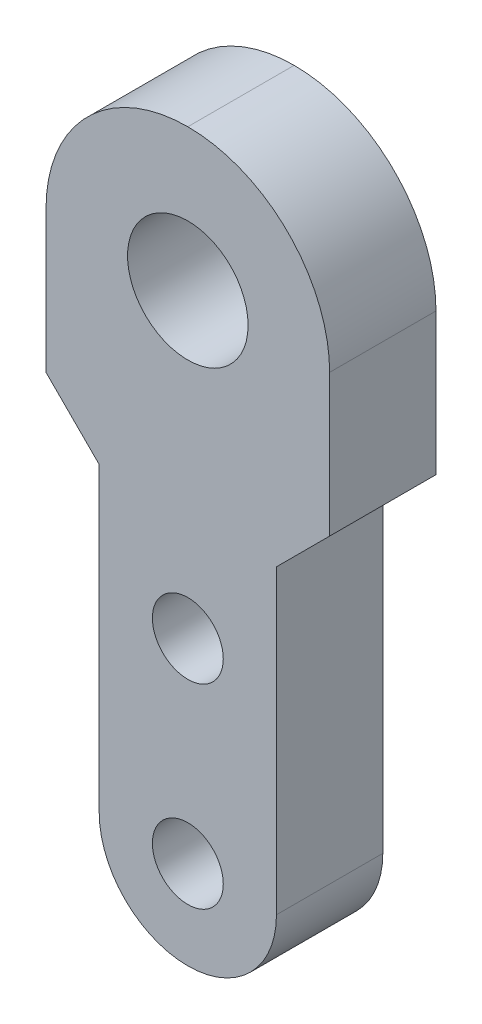
ISO-10303-21;
HEADER;
FILE_DESCRIPTION(('STEP AP214'),'2;1');
FILE_NAME('part.step','',(''),(''),'','','');
FILE_SCHEMA(('AUTOMOTIVE_DESIGN { 1 0 10303 214 1 1 1 1 }'));
ENDSEC;
DATA;
#1=APPLICATION_CONTEXT('core data for automotive mechanical design processes');
#2=APPLICATION_PROTOCOL_DEFINITION('international standard','automotive_design',2000,#1);
#3=PRODUCT_CONTEXT('',#1,'mechanical');
#4=PRODUCT('Part','Part','',(#3));
#5=PRODUCT_RELATED_PRODUCT_CATEGORY('part','',(#4));
#6=PRODUCT_DEFINITION_FORMATION('','',#4);
#7=PRODUCT_DEFINITION_CONTEXT('part definition',#1,'design');
#8=PRODUCT_DEFINITION('design','',#6,#7);
#9=PRODUCT_DEFINITION_SHAPE('','',#8);
#10=(LENGTH_UNIT() NAMED_UNIT(*) SI_UNIT(.MILLI.,.METRE.));
#11=(NAMED_UNIT(*) PLANE_ANGLE_UNIT() SI_UNIT($,.RADIAN.));
#12=(NAMED_UNIT(*) SI_UNIT($,.STERADIAN.) SOLID_ANGLE_UNIT());
#13=UNCERTAINTY_MEASURE_WITH_UNIT(LENGTH_MEASURE(1.E-05),#10,'distance_accuracy_value','');
#14=(GEOMETRIC_REPRESENTATION_CONTEXT(3) GLOBAL_UNCERTAINTY_ASSIGNED_CONTEXT((#13)) GLOBAL_UNIT_ASSIGNED_CONTEXT((#10,
#11,#12)) REPRESENTATION_CONTEXT('',''));
#15=CARTESIAN_POINT('',(0.,0.,0.));
#16=DIRECTION('',(0.,0.,1.));
#17=DIRECTION('',(1.,0.,0.));
#18=AXIS2_PLACEMENT_3D('',#15,#16,#17);
#19=CARTESIAN_POINT('',(0.,0.,6.));
#20=DIRECTION('',(1.,0.,0.));
#21=DIRECTION('',(0.,0.,-1.));
#22=AXIS2_PLACEMENT_3D('',#19,#20,#21);
#23=PLANE('',#22);
#24=DIRECTION('',(0.,-1.,0.));
#25=VECTOR('',#24,1.);
#26=CARTESIAN_POINT('',(0.,0.,0.));
#27=LINE('',#26,#25);
#28=CARTESIAN_POINT('',(0.,22.,0.));
#29=VERTEX_POINT('',#28);
#30=CARTESIAN_POINT('',(0.,5.,0.));
#31=VERTEX_POINT('',#30);
#32=EDGE_CURVE('E116',#29,#31,#27,.T.);
#33=ORIENTED_EDGE('',*,*,#32,.T.);
#34=DIRECTION('',(0.,0.,-1.));
#35=VECTOR('',#34,1.);
#36=CARTESIAN_POINT('',(0.,5.,6.));
#37=LINE('',#36,#35);
#38=CARTESIAN_POINT('',(0.,5.,6.));
#39=VERTEX_POINT('',#38);
#40=EDGE_CURVE('E11',#31,#39,#37,.F.);
#41=ORIENTED_EDGE('',*,*,#40,.T.);
#42=DIRECTION('',(0.,-1.,0.));
#43=VECTOR('',#42,1.);
#44=CARTESIAN_POINT('',(0.,0.,6.));
#45=LINE('',#44,#43);
#46=CARTESIAN_POINT('',(0.,22.,6.));
#47=VERTEX_POINT('',#46);
#48=EDGE_CURVE('E141',#47,#39,#45,.T.);
#49=ORIENTED_EDGE('',*,*,#48,.F.);
#50=DIRECTION('',(0.,0.,-1.));
#51=VECTOR('',#50,1.);
#52=CARTESIAN_POINT('',(0.,22.,6.));
#53=LINE('',#52,#51);
#54=EDGE_CURVE('E167',#47,#29,#53,.T.);
#55=ORIENTED_EDGE('',*,*,#54,.T.);
#56=EDGE_LOOP('',(#33,#41,#49,#55));
#57=FACE_BOUND('',#56,.T.);
#58=ADVANCED_FACE('F32',(#57),#23,.F.);
#59=CARTESIAN_POINT('',(10.,0.,6.));
#60=DIRECTION('',(-1.,0.,0.));
#61=DIRECTION('',(0.,0.,1.));
#62=AXIS2_PLACEMENT_3D('',#59,#60,#61);
#63=PLANE('',#62);
#64=DIRECTION('',(0.,1.,0.));
#65=VECTOR('',#64,1.);
#66=CARTESIAN_POINT('',(10.,0.,6.));
#67=LINE('',#66,#65);
#68=CARTESIAN_POINT('',(10.,5.,6.));
#69=VERTEX_POINT('',#68);
#70=CARTESIAN_POINT('',(10.,22.,6.));
#71=VERTEX_POINT('',#70);
#72=EDGE_CURVE('E143',#69,#71,#67,.T.);
#73=ORIENTED_EDGE('',*,*,#72,.F.);
#74=DIRECTION('',(0.,0.,-1.));
#75=VECTOR('',#74,1.);
#76=CARTESIAN_POINT('',(10.,5.,6.));
#77=LINE('',#76,#75);
#78=CARTESIAN_POINT('',(10.,5.,0.));
#79=VERTEX_POINT('',#78);
#80=EDGE_CURVE('E174',#69,#79,#77,.T.);
#81=ORIENTED_EDGE('',*,*,#80,.T.);
#82=DIRECTION('',(0.,1.,0.));
#83=VECTOR('',#82,1.);
#84=CARTESIAN_POINT('',(10.,0.,0.));
#85=LINE('',#84,#83);
#86=CARTESIAN_POINT('',(10.,22.,0.));
#87=VERTEX_POINT('',#86);
#88=EDGE_CURVE('E144',#79,#87,#85,.T.);
#89=ORIENTED_EDGE('',*,*,#88,.T.);
#90=DIRECTION('',(0.,0.,1.));
#91=VECTOR('',#90,1.);
#92=CARTESIAN_POINT('',(10.,22.,6.));
#93=LINE('',#92,#91);
#94=EDGE_CURVE('E160',#87,#71,#93,.T.);
#95=ORIENTED_EDGE('',*,*,#94,.T.);
#96=EDGE_LOOP('',(#73,#81,#89,#95));
#97=FACE_BOUND('',#96,.T.);
#98=ADVANCED_FACE('F189',(#97),#63,.F.);
#99=CARTESIAN_POINT('',(0.,0.,6.));
#100=DIRECTION('',(0.,0.,-1.));
#101=DIRECTION('',(-1.,0.,0.));
#102=AXIS2_PLACEMENT_3D('',#99,#100,#101);
#103=PLANE('',#102);
#104=CARTESIAN_POINT('',(5.00000000000001,16.,6.));
#105=DIRECTION('',(0.,0.,1.));
#106=DIRECTION('',(1.,0.,0.));
#107=AXIS2_PLACEMENT_3D('',#104,#105,#106);
#108=CIRCLE('',#107,2.);
#109=CARTESIAN_POINT('',(7.00000000000001,16.,6.));
#110=VERTEX_POINT('',#109);
#111=EDGE_CURVE('E248',#110,#110,#108,.T.);
#112=ORIENTED_EDGE('',*,*,#111,.F.);
#113=EDGE_LOOP('',(#112));
#114=FACE_BOUND('',#113,.T.);
#115=CARTESIAN_POINT('',(5.00000000000001,5.,6.));
#116=DIRECTION('',(0.,0.,1.));
#117=DIRECTION('',(1.,0.,0.));
#118=AXIS2_PLACEMENT_3D('',#115,#116,#117);
#119=CIRCLE('',#118,2.);
#120=CARTESIAN_POINT('',(7.00000000000001,5.,6.));
#121=VERTEX_POINT('',#120);
#122=EDGE_CURVE('E164',#121,#121,#119,.T.);
#123=ORIENTED_EDGE('',*,*,#122,.F.);
#124=EDGE_LOOP('',(#123));
#125=FACE_BOUND('',#124,.T.);
#126=CARTESIAN_POINT('',(5.,33.,6.));
#127=DIRECTION('',(0.,0.,1.));
#128=DIRECTION('',(1.,0.,0.));
#129=AXIS2_PLACEMENT_3D('',#126,#127,#128);
#130=CIRCLE('',#129,3.4);
#131=CARTESIAN_POINT('',(8.4,33.,6.));
#132=VERTEX_POINT('',#131);
#133=EDGE_CURVE('E236',#132,#132,#130,.T.);
#134=ORIENTED_EDGE('',*,*,#133,.F.);
#135=EDGE_LOOP('',(#134));
#136=FACE_BOUND('',#135,.T.);
#137=CARTESIAN_POINT('',(5.,5.,6.));
#138=DIRECTION('',(0.,0.,-1.));
#139=DIRECTION('',(-1.,0.,0.));
#140=AXIS2_PLACEMENT_3D('',#137,#138,#139);
#141=CIRCLE('',#140,5.);
#142=CARTESIAN_POINT('',(5.,0.,6.));
#143=VERTEX_POINT('',#142);
#144=EDGE_CURVE('E48',#39,#143,#141,.F.);
#145=ORIENTED_EDGE('',*,*,#144,.T.);
#146=CARTESIAN_POINT('',(5.,5.,6.));
#147=DIRECTION('',(0.,0.,-1.));
#148=DIRECTION('',(-1.,0.,0.));
#149=AXIS2_PLACEMENT_3D('',#146,#147,#148);
#150=CIRCLE('',#149,5.);
#151=EDGE_CURVE('E41',#143,#69,#150,.F.);
#152=ORIENTED_EDGE('',*,*,#151,.T.);
#153=ORIENTED_EDGE('',*,*,#72,.T.);
#154=DIRECTION('',(0.707106781186552,0.707106781186543,0.));
#155=VECTOR('',#154,1.);
#156=CARTESIAN_POINT('',(-6.00000000000007,6.00000000000014,6.));
#157=LINE('',#156,#155);
#158=CARTESIAN_POINT('',(13.,25.,6.));
#159=VERTEX_POINT('',#158);
#160=EDGE_CURVE('E122',#71,#159,#157,.T.);
#161=ORIENTED_EDGE('',*,*,#160,.T.);
#162=DIRECTION('',(0.,1.,0.));
#163=VECTOR('',#162,1.);
#164=CARTESIAN_POINT('',(13.,41.,6.));
#165=LINE('',#164,#163);
#166=CARTESIAN_POINT('',(13.,33.,6.));
#167=VERTEX_POINT('',#166);
#168=EDGE_CURVE('E226',#159,#167,#165,.T.);
#169=ORIENTED_EDGE('',*,*,#168,.T.);
#170=CARTESIAN_POINT('',(5.,33.,6.));
#171=DIRECTION('',(0.,0.,-1.));
#172=DIRECTION('',(-1.,0.,0.));
#173=AXIS2_PLACEMENT_3D('',#170,#171,#172);
#174=CIRCLE('',#173,8.);
#175=CARTESIAN_POINT('',(5.,41.,6.));
#176=VERTEX_POINT('',#175);
#177=EDGE_CURVE('E153',#167,#176,#174,.F.);
#178=ORIENTED_EDGE('',*,*,#177,.T.);
#179=CARTESIAN_POINT('',(5.,33.,6.));
#180=DIRECTION('',(0.,0.,-1.));
#181=DIRECTION('',(-1.,0.,0.));
#182=AXIS2_PLACEMENT_3D('',#179,#180,#181);
#183=CIRCLE('',#182,8.);
#184=CARTESIAN_POINT('',(-3.,33.,6.));
#185=VERTEX_POINT('',#184);
#186=EDGE_CURVE('E151',#176,#185,#183,.F.);
#187=ORIENTED_EDGE('',*,*,#186,.T.);
#188=DIRECTION('',(0.,-1.,0.));
#189=VECTOR('',#188,1.);
#190=CARTESIAN_POINT('',(-3.,41.,6.));
#191=LINE('',#190,#189);
#192=CARTESIAN_POINT('',(-3.,25.,6.));
#193=VERTEX_POINT('',#192);
#194=EDGE_CURVE('E232',#185,#193,#191,.T.);
#195=ORIENTED_EDGE('',*,*,#194,.T.);
#196=DIRECTION('',(0.707106781186544,-0.707106781186551,0.));
#197=VECTOR('',#196,1.);
#198=CARTESIAN_POINT('',(11.,10.9999999999999,6.));
#199=LINE('',#198,#197);
#200=EDGE_CURVE('E121',#193,#47,#199,.T.);
#201=ORIENTED_EDGE('',*,*,#200,.T.);
#202=ORIENTED_EDGE('',*,*,#48,.T.);
#203=EDGE_LOOP('',(#145,#152,#153,#161,#169,#178,#187,#195,#201,#202));
#204=FACE_BOUND('',#203,.T.);
#205=ADVANCED_FACE('F184',(#114,#125,#136,#204),#103,.F.);
#206=CARTESIAN_POINT('',(0.,0.,0.));
#207=DIRECTION('',(0.,0.,-1.));
#208=DIRECTION('',(-1.,0.,0.));
#209=AXIS2_PLACEMENT_3D('',#206,#207,#208);
#210=PLANE('',#209);
#211=CARTESIAN_POINT('',(5.00000000000001,16.,0.));
#212=DIRECTION('',(0.,0.,1.));
#213=DIRECTION('',(1.,0.,0.));
#214=AXIS2_PLACEMENT_3D('',#211,#212,#213);
#215=CIRCLE('',#214,2.);
#216=CARTESIAN_POINT('',(7.00000000000001,16.,0.));
#217=VERTEX_POINT('',#216);
#218=EDGE_CURVE('E241',#217,#217,#215,.T.);
#219=ORIENTED_EDGE('',*,*,#218,.T.);
#220=EDGE_LOOP('',(#219));
#221=FACE_BOUND('',#220,.T.);
#222=CARTESIAN_POINT('',(5.00000000000001,5.,0.));
#223=DIRECTION('',(0.,0.,1.));
#224=DIRECTION('',(1.,0.,0.));
#225=AXIS2_PLACEMENT_3D('',#222,#223,#224);
#226=CIRCLE('',#225,2.);
#227=CARTESIAN_POINT('',(7.00000000000001,5.,0.));
#228=VERTEX_POINT('',#227);
#229=EDGE_CURVE('E245',#228,#228,#226,.T.);
#230=ORIENTED_EDGE('',*,*,#229,.T.);
#231=EDGE_LOOP('',(#230));
#232=FACE_BOUND('',#231,.T.);
#233=CARTESIAN_POINT('',(5.,33.,0.));
#234=DIRECTION('',(0.,0.,1.));
#235=DIRECTION('',(1.,0.,0.));
#236=AXIS2_PLACEMENT_3D('',#233,#234,#235);
#237=CIRCLE('',#236,3.4);
#238=CARTESIAN_POINT('',(8.4,33.,0.));
#239=VERTEX_POINT('',#238);
#240=EDGE_CURVE('E233',#239,#239,#237,.T.);
#241=ORIENTED_EDGE('',*,*,#240,.T.);
#242=EDGE_LOOP('',(#241));
#243=FACE_BOUND('',#242,.T.);
#244=ORIENTED_EDGE('',*,*,#88,.F.);
#245=CARTESIAN_POINT('',(5.,5.,0.));
#246=DIRECTION('',(0.,0.,-1.));
#247=DIRECTION('',(-1.,0.,0.));
#248=AXIS2_PLACEMENT_3D('',#245,#246,#247);
#249=CIRCLE('',#248,5.);
#250=CARTESIAN_POINT('',(5.,0.,0.));
#251=VERTEX_POINT('',#250);
#252=EDGE_CURVE('E179',#79,#251,#249,.T.);
#253=ORIENTED_EDGE('',*,*,#252,.T.);
#254=CARTESIAN_POINT('',(5.,5.,0.));
#255=DIRECTION('',(0.,0.,-1.));
#256=DIRECTION('',(-1.,0.,0.));
#257=AXIS2_PLACEMENT_3D('',#254,#255,#256);
#258=CIRCLE('',#257,5.);
#259=EDGE_CURVE('E177',#251,#31,#258,.T.);
#260=ORIENTED_EDGE('',*,*,#259,.T.);
#261=ORIENTED_EDGE('',*,*,#32,.F.);
#262=DIRECTION('',(-0.707106781186544,0.707106781186551,0.));
#263=VECTOR('',#262,1.);
#264=CARTESIAN_POINT('',(0.,22.,0.));
#265=LINE('',#264,#263);
#266=CARTESIAN_POINT('',(-3.,25.,0.));
#267=VERTEX_POINT('',#266);
#268=EDGE_CURVE('E110',#29,#267,#265,.T.);
#269=ORIENTED_EDGE('',*,*,#268,.T.);
#270=DIRECTION('',(0.,-1.,0.));
#271=VECTOR('',#270,1.);
#272=CARTESIAN_POINT('',(-3.,41.,0.));
#273=LINE('',#272,#271);
#274=CARTESIAN_POINT('',(-3.,33.,0.));
#275=VERTEX_POINT('',#274);
#276=EDGE_CURVE('E114',#275,#267,#273,.T.);
#277=ORIENTED_EDGE('',*,*,#276,.F.);
#278=CARTESIAN_POINT('',(5.,33.,0.));
#279=DIRECTION('',(0.,0.,-1.));
#280=DIRECTION('',(-1.,0.,0.));
#281=AXIS2_PLACEMENT_3D('',#278,#279,#280);
#282=CIRCLE('',#281,8.);
#283=CARTESIAN_POINT('',(5.,41.,0.));
#284=VERTEX_POINT('',#283);
#285=EDGE_CURVE('E155',#275,#284,#282,.T.);
#286=ORIENTED_EDGE('',*,*,#285,.T.);
#287=CARTESIAN_POINT('',(5.,33.,0.));
#288=DIRECTION('',(0.,0.,-1.));
#289=DIRECTION('',(-1.,0.,0.));
#290=AXIS2_PLACEMENT_3D('',#287,#288,#289);
#291=CIRCLE('',#290,8.);
#292=CARTESIAN_POINT('',(13.,33.,0.));
#293=VERTEX_POINT('',#292);
#294=EDGE_CURVE('E157',#284,#293,#291,.T.);
#295=ORIENTED_EDGE('',*,*,#294,.T.);
#296=DIRECTION('',(0.,1.,0.));
#297=VECTOR('',#296,1.);
#298=CARTESIAN_POINT('',(13.,41.,0.));
#299=LINE('',#298,#297);
#300=CARTESIAN_POINT('',(13.,25.,0.));
#301=VERTEX_POINT('',#300);
#302=EDGE_CURVE('E132',#301,#293,#299,.T.);
#303=ORIENTED_EDGE('',*,*,#302,.F.);
#304=DIRECTION('',(-0.707106781186552,-0.707106781186543,0.));
#305=VECTOR('',#304,1.);
#306=CARTESIAN_POINT('',(13.,25.,0.));
#307=LINE('',#306,#305);
#308=EDGE_CURVE('E169',#301,#87,#307,.T.);
#309=ORIENTED_EDGE('',*,*,#308,.T.);
#310=EDGE_LOOP('',(#244,#253,#260,#261,#269,#277,#286,#295,#303,#309));
#311=FACE_BOUND('',#310,.T.);
#312=ADVANCED_FACE('F113',(#221,#232,#243,#311),#210,.T.);
#313=CARTESIAN_POINT('',(13.,41.,0.));
#314=DIRECTION('',(1.,0.,0.));
#315=DIRECTION('',(0.,1.,0.));
#316=AXIS2_PLACEMENT_3D('',#313,#314,#315);
#317=PLANE('',#316);
#318=ORIENTED_EDGE('',*,*,#302,.T.);
#319=DIRECTION('',(0.,0.,1.));
#320=VECTOR('',#319,1.);
#321=CARTESIAN_POINT('',(13.,33.,0.));
#322=LINE('',#321,#320);
#323=EDGE_CURVE('E146',#293,#167,#322,.T.);
#324=ORIENTED_EDGE('',*,*,#323,.T.);
#325=ORIENTED_EDGE('',*,*,#168,.F.);
#326=DIRECTION('',(0.,0.,1.));
#327=VECTOR('',#326,1.);
#328=CARTESIAN_POINT('',(13.,25.,0.));
#329=LINE('',#328,#327);
#330=EDGE_CURVE('E135',#301,#159,#329,.T.);
#331=ORIENTED_EDGE('',*,*,#330,.F.);
#332=EDGE_LOOP('',(#318,#324,#325,#331));
#333=FACE_BOUND('',#332,.T.);
#334=ADVANCED_FACE('F229',(#333),#317,.T.);
#335=CARTESIAN_POINT('',(-3.,41.,0.));
#336=DIRECTION('',(-1.,0.,0.));
#337=DIRECTION('',(0.,-1.,0.));
#338=AXIS2_PLACEMENT_3D('',#335,#336,#337);
#339=PLANE('',#338);
#340=ORIENTED_EDGE('',*,*,#194,.F.);
#341=DIRECTION('',(0.,0.,1.));
#342=VECTOR('',#341,1.);
#343=CARTESIAN_POINT('',(-3.,33.,0.));
#344=LINE('',#343,#342);
#345=EDGE_CURVE('E131',#185,#275,#344,.F.);
#346=ORIENTED_EDGE('',*,*,#345,.T.);
#347=ORIENTED_EDGE('',*,*,#276,.T.);
#348=DIRECTION('',(0.,0.,1.));
#349=VECTOR('',#348,1.);
#350=CARTESIAN_POINT('',(-3.,25.,0.));
#351=LINE('',#350,#349);
#352=EDGE_CURVE('E128',#267,#193,#351,.T.);
#353=ORIENTED_EDGE('',*,*,#352,.T.);
#354=EDGE_LOOP('',(#340,#346,#347,#353));
#355=FACE_BOUND('',#354,.T.);
#356=ADVANCED_FACE('F127',(#355),#339,.T.);
#357=CARTESIAN_POINT('',(5.,33.,0.));
#358=DIRECTION('',(0.,0.,1.));
#359=DIRECTION('',(1.,0.,0.));
#360=AXIS2_PLACEMENT_3D('',#357,#358,#359);
#361=CYLINDRICAL_SURFACE('',#360,3.4);
#362=ORIENTED_EDGE('',*,*,#240,.F.);
#363=EDGE_LOOP('',(#362));
#364=FACE_BOUND('',#363,.T.);
#365=ORIENTED_EDGE('',*,*,#133,.T.);
#366=EDGE_LOOP('',(#365));
#367=FACE_BOUND('',#366,.T.);
#368=ADVANCED_FACE('F269',(#364,#367),#361,.F.);
#369=CARTESIAN_POINT('',(5.00000000000001,5.,0.));
#370=DIRECTION('',(0.,0.,1.));
#371=DIRECTION('',(1.,0.,0.));
#372=AXIS2_PLACEMENT_3D('',#369,#370,#371);
#373=CYLINDRICAL_SURFACE('',#372,2.);
#374=ORIENTED_EDGE('',*,*,#229,.F.);
#375=EDGE_LOOP('',(#374));
#376=FACE_BOUND('',#375,.T.);
#377=ORIENTED_EDGE('',*,*,#122,.T.);
#378=EDGE_LOOP('',(#377));
#379=FACE_BOUND('',#378,.T.);
#380=ADVANCED_FACE('F258',(#376,#379),#373,.F.);
#381=CARTESIAN_POINT('',(5.00000000000001,16.,0.));
#382=DIRECTION('',(0.,0.,1.));
#383=DIRECTION('',(1.,0.,0.));
#384=AXIS2_PLACEMENT_3D('',#381,#382,#383);
#385=CYLINDRICAL_SURFACE('',#384,2.);
#386=ORIENTED_EDGE('',*,*,#218,.F.);
#387=EDGE_LOOP('',(#386));
#388=FACE_BOUND('',#387,.T.);
#389=ORIENTED_EDGE('',*,*,#111,.T.);
#390=EDGE_LOOP('',(#389));
#391=FACE_BOUND('',#390,.T.);
#392=ADVANCED_FACE('F217',(#388,#391),#385,.F.);
#393=CARTESIAN_POINT('',(5.,33.,0.));
#394=DIRECTION('',(0.,0.,1.));
#395=DIRECTION('',(1.,0.,0.));
#396=AXIS2_PLACEMENT_3D('',#393,#394,#395);
#397=CYLINDRICAL_SURFACE('',#396,8.);
#398=DIRECTION('',(0.,0.,1.));
#399=VECTOR('',#398,1.);
#400=CARTESIAN_POINT('',(5.,41.,0.));
#401=LINE('',#400,#399);
#402=EDGE_CURVE('E161',#284,#176,#401,.T.);
#403=ORIENTED_EDGE('',*,*,#402,.F.);
#404=ORIENTED_EDGE('',*,*,#285,.F.);
#405=ORIENTED_EDGE('',*,*,#345,.F.);
#406=ORIENTED_EDGE('',*,*,#186,.F.);
#407=EDGE_LOOP('',(#403,#404,#405,#406));
#408=FACE_BOUND('',#407,.T.);
#409=ADVANCED_FACE('F213',(#408),#397,.T.);
#410=CARTESIAN_POINT('',(5.,33.,0.));
#411=DIRECTION('',(0.,0.,1.));
#412=DIRECTION('',(1.,0.,0.));
#413=AXIS2_PLACEMENT_3D('',#410,#411,#412);
#414=CYLINDRICAL_SURFACE('',#413,8.);
#415=ORIENTED_EDGE('',*,*,#294,.F.);
#416=ORIENTED_EDGE('',*,*,#402,.T.);
#417=ORIENTED_EDGE('',*,*,#177,.F.);
#418=ORIENTED_EDGE('',*,*,#323,.F.);
#419=EDGE_LOOP('',(#415,#416,#417,#418));
#420=FACE_BOUND('',#419,.T.);
#421=ADVANCED_FACE('F210',(#420),#414,.T.);
#422=CARTESIAN_POINT('',(13.,25.,0.));
#423=DIRECTION('',(-0.707106781186543,0.707106781186552,0.));
#424=DIRECTION('',(0.,0.,-1.));
#425=AXIS2_PLACEMENT_3D('',#422,#423,#424);
#426=PLANE('',#425);
#427=ORIENTED_EDGE('',*,*,#160,.F.);
#428=ORIENTED_EDGE('',*,*,#94,.F.);
#429=ORIENTED_EDGE('',*,*,#308,.F.);
#430=ORIENTED_EDGE('',*,*,#330,.T.);
#431=EDGE_LOOP('',(#427,#428,#429,#430));
#432=FACE_BOUND('',#431,.T.);
#433=ADVANCED_FACE('F200',(#432),#426,.F.);
#434=CARTESIAN_POINT('',(0.,22.,6.));
#435=DIRECTION('',(0.707106781186551,0.707106781186544,0.));
#436=DIRECTION('',(0.,0.,-1.));
#437=AXIS2_PLACEMENT_3D('',#434,#435,#436);
#438=PLANE('',#437);
#439=ORIENTED_EDGE('',*,*,#200,.F.);
#440=ORIENTED_EDGE('',*,*,#352,.F.);
#441=ORIENTED_EDGE('',*,*,#268,.F.);
#442=ORIENTED_EDGE('',*,*,#54,.F.);
#443=EDGE_LOOP('',(#439,#440,#441,#442));
#444=FACE_BOUND('',#443,.T.);
#445=ADVANCED_FACE('F134',(#444),#438,.F.);
#446=CARTESIAN_POINT('',(5.,5.,6.));
#447=DIRECTION('',(0.,0.,-1.));
#448=DIRECTION('',(-1.,0.,0.));
#449=AXIS2_PLACEMENT_3D('',#446,#447,#448);
#450=CYLINDRICAL_SURFACE('',#449,5.);
#451=DIRECTION('',(0.,0.,-1.));
#452=VECTOR('',#451,1.);
#453=CARTESIAN_POINT('',(5.,0.,6.));
#454=LINE('',#453,#452);
#455=EDGE_CURVE('E36',#143,#251,#454,.T.);
#456=ORIENTED_EDGE('',*,*,#455,.F.);
#457=ORIENTED_EDGE('',*,*,#144,.F.);
#458=ORIENTED_EDGE('',*,*,#40,.F.);
#459=ORIENTED_EDGE('',*,*,#259,.F.);
#460=EDGE_LOOP('',(#456,#457,#458,#459));
#461=FACE_BOUND('',#460,.T.);
#462=ADVANCED_FACE('F34',(#461),#450,.T.);
#463=CARTESIAN_POINT('',(5.,5.,6.));
#464=DIRECTION('',(0.,0.,-1.));
#465=DIRECTION('',(-1.,0.,0.));
#466=AXIS2_PLACEMENT_3D('',#463,#464,#465);
#467=CYLINDRICAL_SURFACE('',#466,5.);
#468=ORIENTED_EDGE('',*,*,#151,.F.);
#469=ORIENTED_EDGE('',*,*,#455,.T.);
#470=ORIENTED_EDGE('',*,*,#252,.F.);
#471=ORIENTED_EDGE('',*,*,#80,.F.);
#472=EDGE_LOOP('',(#468,#469,#470,#471));
#473=FACE_BOUND('',#472,.T.);
#474=ADVANCED_FACE('F192',(#473),#467,.T.);
#475=CLOSED_SHELL('',(#58,#98,#205,#312,#334,#356,#368,#380,#392,#409,#421,#433,#445,#462,#474));
#476=MANIFOLD_SOLID_BREP('B2',#475);
#477=ADVANCED_BREP_SHAPE_REPRESENTATION('',(#18,#476),#14);
#478=SHAPE_DEFINITION_REPRESENTATION(#9,#477);
ENDSEC;
END-ISO-10303-21;
